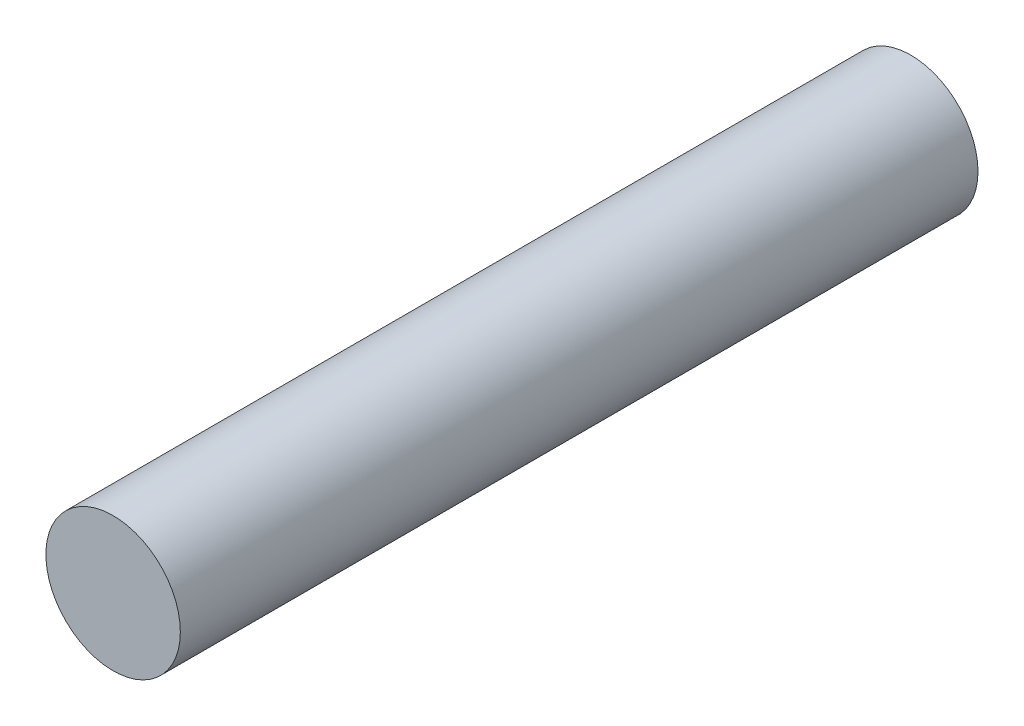
ISO-10303-21;
HEADER;
FILE_DESCRIPTION(('STEP AP214'),'2;1');
FILE_NAME('part.step','',(''),(''),'','','');
FILE_SCHEMA(('AUTOMOTIVE_DESIGN { 1 0 10303 214 1 1 1 1 }'));
ENDSEC;
DATA;
#1=APPLICATION_CONTEXT('core data for automotive mechanical design processes');
#2=APPLICATION_PROTOCOL_DEFINITION('international standard','automotive_design',2000,#1);
#3=PRODUCT_CONTEXT('',#1,'mechanical');
#4=PRODUCT('Part','Part','',(#3));
#5=PRODUCT_RELATED_PRODUCT_CATEGORY('part','',(#4));
#6=PRODUCT_DEFINITION_FORMATION('','',#4);
#7=PRODUCT_DEFINITION_CONTEXT('part definition',#1,'design');
#8=PRODUCT_DEFINITION('design','',#6,#7);
#9=PRODUCT_DEFINITION_SHAPE('','',#8);
#10=(LENGTH_UNIT() NAMED_UNIT(*) SI_UNIT(.MILLI.,.METRE.));
#11=(NAMED_UNIT(*) PLANE_ANGLE_UNIT() SI_UNIT($,.RADIAN.));
#12=(NAMED_UNIT(*) SI_UNIT($,.STERADIAN.) SOLID_ANGLE_UNIT());
#13=UNCERTAINTY_MEASURE_WITH_UNIT(LENGTH_MEASURE(1.E-05),#10,'distance_accuracy_value','');
#14=(GEOMETRIC_REPRESENTATION_CONTEXT(3) GLOBAL_UNCERTAINTY_ASSIGNED_CONTEXT((#13)) GLOBAL_UNIT_ASSIGNED_CONTEXT((#10,
#11,#12)) REPRESENTATION_CONTEXT('',''));
#15=CARTESIAN_POINT('',(0.,0.,0.));
#16=DIRECTION('',(0.,0.,1.));
#17=DIRECTION('',(1.,0.,0.));
#18=AXIS2_PLACEMENT_3D('',#15,#16,#17);
#19=CARTESIAN_POINT('',(0.,0.,35.));
#20=DIRECTION('',(0.,0.,-1.));
#21=DIRECTION('',(-1.,0.,0.));
#22=AXIS2_PLACEMENT_3D('',#19,#20,#21);
#23=CYLINDRICAL_SURFACE('',#22,2.95);
#24=CARTESIAN_POINT('',(0.,0.,35.));
#25=DIRECTION('',(0.,0.,1.));
#26=DIRECTION('',(1.,0.,0.));
#27=AXIS2_PLACEMENT_3D('',#24,#25,#26);
#28=CIRCLE('',#27,2.95);
#29=CARTESIAN_POINT('',(2.95,0.,35.));
#30=VERTEX_POINT('',#29);
#31=EDGE_CURVE('E11',#30,#30,#28,.T.);
#32=ORIENTED_EDGE('',*,*,#31,.F.);
#33=EDGE_LOOP('',(#32));
#34=FACE_BOUND('',#33,.T.);
#35=CARTESIAN_POINT('',(0.,0.,0.));
#36=DIRECTION('',(0.,0.,1.));
#37=DIRECTION('',(1.,0.,0.));
#38=AXIS2_PLACEMENT_3D('',#35,#36,#37);
#39=CIRCLE('',#38,2.95);
#40=CARTESIAN_POINT('',(2.95,0.,0.));
#41=VERTEX_POINT('',#40);
#42=EDGE_CURVE('E36',#41,#41,#39,.T.);
#43=ORIENTED_EDGE('',*,*,#42,.T.);
#44=EDGE_LOOP('',(#43));
#45=FACE_BOUND('',#44,.T.);
#46=ADVANCED_FACE('F33',(#34,#45),#23,.T.);
#47=CARTESIAN_POINT('',(0.,0.,35.));
#48=DIRECTION('',(0.,0.,1.));
#49=DIRECTION('',(1.,0.,0.));
#50=AXIS2_PLACEMENT_3D('',#47,#48,#49);
#51=PLANE('',#50);
#52=ORIENTED_EDGE('',*,*,#31,.T.);
#53=EDGE_LOOP('',(#52));
#54=FACE_BOUND('',#53,.T.);
#55=ADVANCED_FACE('F86',(#54),#51,.T.);
#56=CARTESIAN_POINT('',(0.,0.,0.));
#57=DIRECTION('',(0.,0.,1.));
#58=DIRECTION('',(1.,0.,0.));
#59=AXIS2_PLACEMENT_3D('',#56,#57,#58);
#60=PLANE('',#59);
#61=DIRECTION('',(1.,0.,0.));
#62=VECTOR('',#61,1.);
#63=CARTESIAN_POINT('',(1.29614813968157,1.51,0.));
#64=LINE('',#63,#62);
#65=CARTESIAN_POINT('',(-1.29614813968157,1.51,0.));
#66=VERTEX_POINT('',#65);
#67=CARTESIAN_POINT('',(1.29614813968157,1.51,0.));
#68=VERTEX_POINT('',#67);
#69=EDGE_CURVE('E66',#66,#68,#64,.T.);
#70=ORIENTED_EDGE('',*,*,#69,.F.);
#71=CARTESIAN_POINT('',(0.,0.,0.));
#72=DIRECTION('',(0.,0.,-1.));
#73=DIRECTION('',(-1.,0.,0.));
#74=AXIS2_PLACEMENT_3D('',#71,#72,#73);
#75=CIRCLE('',#74,1.99);
#76=EDGE_CURVE('E47',#68,#66,#75,.T.);
#77=ORIENTED_EDGE('',*,*,#76,.F.);
#78=EDGE_LOOP('',(#70,#77));
#79=FACE_BOUND('',#78,.T.);
#80=ORIENTED_EDGE('',*,*,#42,.F.);
#81=EDGE_LOOP('',(#80));
#82=FACE_BOUND('',#81,.T.);
#83=ADVANCED_FACE('F70',(#79,#82),#60,.F.);
#84=CARTESIAN_POINT('',(0.,0.,7.));
#85=DIRECTION('',(0.,0.,-1.));
#86=DIRECTION('',(-1.,0.,0.));
#87=AXIS2_PLACEMENT_3D('',#84,#85,#86);
#88=CYLINDRICAL_SURFACE('',#87,1.99);
#89=ORIENTED_EDGE('',*,*,#76,.T.);
#90=DIRECTION('',(0.,0.,-1.));
#91=VECTOR('',#90,1.);
#92=CARTESIAN_POINT('',(-1.29614813968157,1.51,7.));
#93=LINE('',#92,#91);
#94=CARTESIAN_POINT('',(-1.29614813968157,1.51,7.));
#95=VERTEX_POINT('',#94);
#96=EDGE_CURVE('E63',#95,#66,#93,.T.);
#97=ORIENTED_EDGE('',*,*,#96,.F.);
#98=CARTESIAN_POINT('',(0.,0.,7.));
#99=DIRECTION('',(0.,0.,-1.));
#100=DIRECTION('',(-1.,0.,0.));
#101=AXIS2_PLACEMENT_3D('',#98,#99,#100);
#102=CIRCLE('',#101,1.99);
#103=CARTESIAN_POINT('',(1.29614813968157,1.51,7.));
#104=VERTEX_POINT('',#103);
#105=EDGE_CURVE('E61',#104,#95,#102,.T.);
#106=ORIENTED_EDGE('',*,*,#105,.F.);
#107=DIRECTION('',(0.,0.,-1.));
#108=VECTOR('',#107,1.);
#109=CARTESIAN_POINT('',(1.29614813968157,1.51,7.));
#110=LINE('',#109,#108);
#111=EDGE_CURVE('E55',#104,#68,#110,.T.);
#112=ORIENTED_EDGE('',*,*,#111,.T.);
#113=EDGE_LOOP('',(#89,#97,#106,#112));
#114=FACE_BOUND('',#113,.T.);
#115=ADVANCED_FACE('F59',(#114),#88,.F.);
#116=CARTESIAN_POINT('',(1.29614813968157,1.51,7.));
#117=DIRECTION('',(0.,1.,0.));
#118=DIRECTION('',(0.,0.,1.));
#119=AXIS2_PLACEMENT_3D('',#116,#117,#118);
#120=PLANE('',#119);
#121=ORIENTED_EDGE('',*,*,#69,.T.);
#122=ORIENTED_EDGE('',*,*,#111,.F.);
#123=DIRECTION('',(1.,0.,0.));
#124=VECTOR('',#123,1.);
#125=CARTESIAN_POINT('',(1.29614813968157,1.51,7.));
#126=LINE('',#125,#124);
#127=EDGE_CURVE('E74',#95,#104,#126,.T.);
#128=ORIENTED_EDGE('',*,*,#127,.F.);
#129=ORIENTED_EDGE('',*,*,#96,.T.);
#130=EDGE_LOOP('',(#121,#122,#128,#129));
#131=FACE_BOUND('',#130,.T.);
#132=ADVANCED_FACE('F67',(#131),#120,.F.);
#133=CARTESIAN_POINT('',(0.,0.,7.));
#134=DIRECTION('',(0.,0.,-1.));
#135=DIRECTION('',(-1.,0.,0.));
#136=AXIS2_PLACEMENT_3D('',#133,#134,#135);
#137=PLANE('',#136);
#138=ORIENTED_EDGE('',*,*,#105,.T.);
#139=ORIENTED_EDGE('',*,*,#127,.T.);
#140=EDGE_LOOP('',(#138,#139));
#141=FACE_BOUND('',#140,.T.);
#142=ADVANCED_FACE('F78',(#141),#137,.T.);
#143=CLOSED_SHELL('',(#46,#55,#83,#115,#132,#142));
#144=MANIFOLD_SOLID_BREP('B2',#143);
#145=ADVANCED_BREP_SHAPE_REPRESENTATION('',(#18,#144),#14);
#146=SHAPE_DEFINITION_REPRESENTATION(#9,#145);
ENDSEC;
END-ISO-10303-21;
